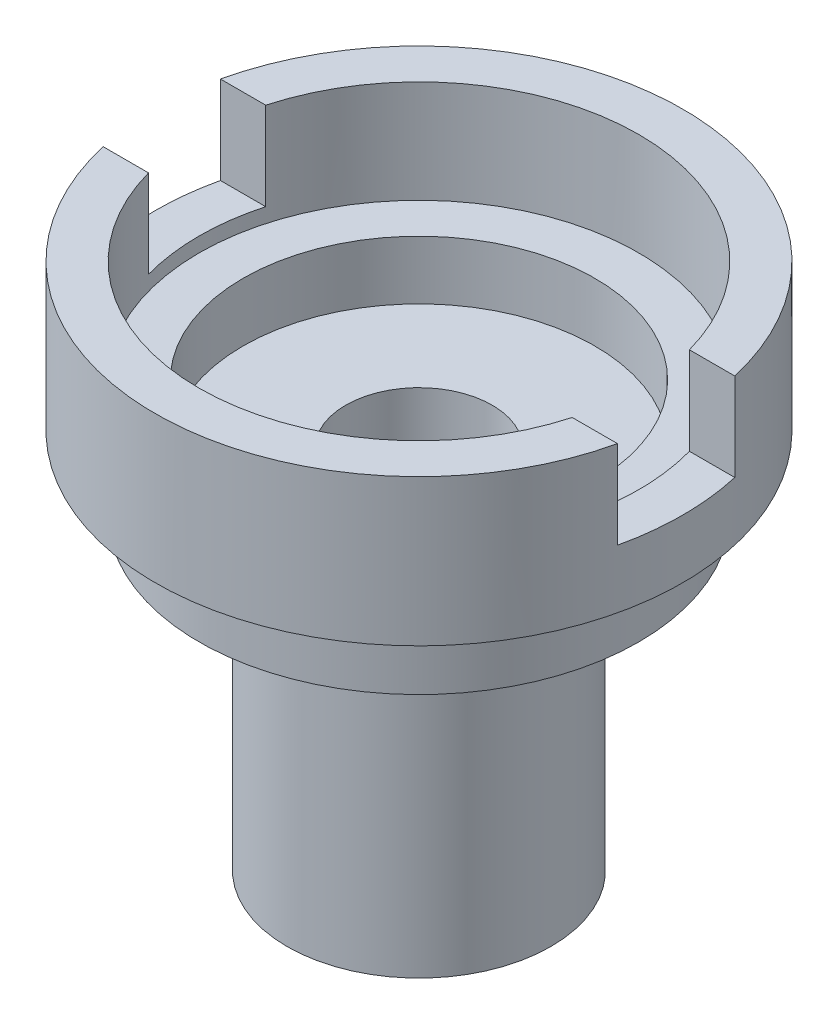
ISO-10303-21;
HEADER;
FILE_DESCRIPTION(('STEP AP214'),'2;1');
FILE_NAME('part.step','',(''),(''),'','','');
FILE_SCHEMA(('AUTOMOTIVE_DESIGN { 1 0 10303 214 1 1 1 1 }'));
ENDSEC;
DATA;
#1=APPLICATION_CONTEXT('core data for automotive mechanical design processes');
#2=APPLICATION_PROTOCOL_DEFINITION('international standard','automotive_design',2000,#1);
#3=PRODUCT_CONTEXT('',#1,'mechanical');
#4=PRODUCT('Part','Part','',(#3));
#5=PRODUCT_RELATED_PRODUCT_CATEGORY('part','',(#4));
#6=PRODUCT_DEFINITION_FORMATION('','',#4);
#7=PRODUCT_DEFINITION_CONTEXT('part definition',#1,'design');
#8=PRODUCT_DEFINITION('design','',#6,#7);
#9=PRODUCT_DEFINITION_SHAPE('','',#8);
#10=(LENGTH_UNIT() NAMED_UNIT(*) SI_UNIT(.MILLI.,.METRE.));
#11=(NAMED_UNIT(*) PLANE_ANGLE_UNIT() SI_UNIT($,.RADIAN.));
#12=(NAMED_UNIT(*) SI_UNIT($,.STERADIAN.) SOLID_ANGLE_UNIT());
#13=UNCERTAINTY_MEASURE_WITH_UNIT(LENGTH_MEASURE(1.E-05),#10,'distance_accuracy_value','');
#14=(GEOMETRIC_REPRESENTATION_CONTEXT(3) GLOBAL_UNCERTAINTY_ASSIGNED_CONTEXT((#13)) GLOBAL_UNIT_ASSIGNED_CONTEXT((#10,
#11,#12)) REPRESENTATION_CONTEXT('',''));
#15=CARTESIAN_POINT('',(0.,0.,0.));
#16=DIRECTION('',(0.,0.,1.));
#17=DIRECTION('',(1.,0.,0.));
#18=AXIS2_PLACEMENT_3D('',#15,#16,#17);
#19=CARTESIAN_POINT('',(-90.,180.,0.));
#20=DIRECTION('',(0.,1.,0.));
#21=DIRECTION('',(-1.,0.,0.));
#22=AXIS2_PLACEMENT_3D('',#19,#20,#21);
#23=PLANE('',#22);
#24=CARTESIAN_POINT('',(0.,180.,0.));
#25=DIRECTION('',(0.,1.,0.));
#26=DIRECTION('',(-1.,0.,0.));
#27=AXIS2_PLACEMENT_3D('',#24,#25,#26);
#28=CIRCLE('',#27,90.);
#29=CARTESIAN_POINT('',(87.7496438739211,180.,-20.));
#30=VERTEX_POINT('',#29);
#31=CARTESIAN_POINT('',(-87.7496438739212,180.,-20.));
#32=VERTEX_POINT('',#31);
#33=EDGE_CURVE('E136',#30,#32,#28,.T.);
#34=ORIENTED_EDGE('',*,*,#33,.T.);
#35=DIRECTION('',(1.,0.,0.));
#36=VECTOR('',#35,1.);
#37=CARTESIAN_POINT('',(-114.831719663084,180.,-20.));
#38=LINE('',#37,#36);
#39=CARTESIAN_POINT('',(-72.2841614740047,180.,-20.));
#40=VERTEX_POINT('',#39);
#41=EDGE_CURVE('E188',#32,#40,#38,.T.);
#42=ORIENTED_EDGE('',*,*,#41,.T.);
#43=CARTESIAN_POINT('',(0.,180.,0.));
#44=DIRECTION('',(0.,1.,0.));
#45=DIRECTION('',(-1.,0.,0.));
#46=AXIS2_PLACEMENT_3D('',#43,#44,#45);
#47=CIRCLE('',#46,75.);
#48=CARTESIAN_POINT('',(72.2841614740048,180.,-20.));
#49=VERTEX_POINT('',#48);
#50=EDGE_CURVE('E195',#49,#40,#47,.T.);
#51=ORIENTED_EDGE('',*,*,#50,.F.);
#52=EDGE_CURVE('E127',#49,#30,#38,.T.);
#53=ORIENTED_EDGE('',*,*,#52,.T.);
#54=EDGE_LOOP('',(#34,#42,#51,#53));
#55=FACE_BOUND('',#54,.T.);
#56=ADVANCED_FACE('F42',(#55),#23,.T.);
#57=CARTESIAN_POINT('',(0.,0.,0.));
#58=DIRECTION('',(0.,-1.,0.));
#59=DIRECTION('',(1.,0.,0.));
#60=AXIS2_PLACEMENT_3D('',#57,#58,#59);
#61=PLANE('',#60);
#62=CARTESIAN_POINT('',(0.,0.,0.));
#63=DIRECTION('',(0.,1.,0.));
#64=DIRECTION('',(-1.,0.,0.));
#65=AXIS2_PLACEMENT_3D('',#62,#63,#64);
#66=CIRCLE('',#65,25.);
#67=CARTESIAN_POINT('',(-25.,0.,0.));
#68=VERTEX_POINT('',#67);
#69=EDGE_CURVE('E194',#68,#68,#66,.T.);
#70=ORIENTED_EDGE('',*,*,#69,.T.);
#71=EDGE_LOOP('',(#70));
#72=FACE_BOUND('',#71,.T.);
#73=CARTESIAN_POINT('',(0.,0.,0.));
#74=DIRECTION('',(0.,1.,0.));
#75=DIRECTION('',(-1.,0.,0.));
#76=AXIS2_PLACEMENT_3D('',#73,#74,#75);
#77=CIRCLE('',#76,45.);
#78=CARTESIAN_POINT('',(-45.,0.,0.));
#79=VERTEX_POINT('',#78);
#80=EDGE_CURVE('E159',#79,#79,#77,.T.);
#81=ORIENTED_EDGE('',*,*,#80,.F.);
#82=EDGE_LOOP('',(#81));
#83=FACE_BOUND('',#82,.T.);
#84=ADVANCED_FACE('F44',(#72,#83),#61,.T.);
#85=CARTESIAN_POINT('',(0.,209.327847516351,0.));
#86=DIRECTION('',(0.,1.,0.));
#87=DIRECTION('',(-1.,0.,0.));
#88=AXIS2_PLACEMENT_3D('',#85,#86,#87);
#89=CYLINDRICAL_SURFACE('',#88,45.);
#90=ORIENTED_EDGE('',*,*,#80,.T.);
#91=EDGE_LOOP('',(#90));
#92=FACE_BOUND('',#91,.T.);
#93=CARTESIAN_POINT('',(0.,105.,0.));
#94=DIRECTION('',(0.,1.,0.));
#95=DIRECTION('',(-1.,0.,0.));
#96=AXIS2_PLACEMENT_3D('',#93,#94,#95);
#97=CIRCLE('',#96,45.);
#98=CARTESIAN_POINT('',(-45.,105.,0.));
#99=VERTEX_POINT('',#98);
#100=EDGE_CURVE('E155',#99,#99,#97,.T.);
#101=ORIENTED_EDGE('',*,*,#100,.F.);
#102=EDGE_LOOP('',(#101));
#103=FACE_BOUND('',#102,.T.);
#104=ADVANCED_FACE('F260',(#92,#103),#89,.T.);
#105=CARTESIAN_POINT('',(-45.,105.,0.));
#106=DIRECTION('',(0.,-1.,0.));
#107=DIRECTION('',(1.,0.,0.));
#108=AXIS2_PLACEMENT_3D('',#105,#106,#107);
#109=PLANE('',#108);
#110=ORIENTED_EDGE('',*,*,#100,.T.);
#111=EDGE_LOOP('',(#110));
#112=FACE_BOUND('',#111,.T.);
#113=CARTESIAN_POINT('',(0.,105.,0.));
#114=DIRECTION('',(0.,1.,0.));
#115=DIRECTION('',(-1.,0.,0.));
#116=AXIS2_PLACEMENT_3D('',#113,#114,#115);
#117=CIRCLE('',#116,75.);
#118=CARTESIAN_POINT('',(-75.,105.,0.));
#119=VERTEX_POINT('',#118);
#120=EDGE_CURVE('E151',#119,#119,#117,.T.);
#121=ORIENTED_EDGE('',*,*,#120,.F.);
#122=EDGE_LOOP('',(#121));
#123=FACE_BOUND('',#122,.T.);
#124=ADVANCED_FACE('F282',(#112,#123),#109,.T.);
#125=CARTESIAN_POINT('',(0.,209.327847516351,0.));
#126=DIRECTION('',(0.,1.,0.));
#127=DIRECTION('',(-1.,0.,0.));
#128=AXIS2_PLACEMENT_3D('',#125,#126,#127);
#129=CYLINDRICAL_SURFACE('',#128,75.);
#130=ORIENTED_EDGE('',*,*,#120,.T.);
#131=EDGE_LOOP('',(#130));
#132=FACE_BOUND('',#131,.T.);
#133=CARTESIAN_POINT('',(0.,130.,0.));
#134=DIRECTION('',(0.,1.,0.));
#135=DIRECTION('',(-1.,0.,0.));
#136=AXIS2_PLACEMENT_3D('',#133,#134,#135);
#137=CIRCLE('',#136,75.);
#138=CARTESIAN_POINT('',(-75.,130.,0.));
#139=VERTEX_POINT('',#138);
#140=EDGE_CURVE('E141',#139,#139,#137,.T.);
#141=ORIENTED_EDGE('',*,*,#140,.F.);
#142=EDGE_LOOP('',(#141));
#143=FACE_BOUND('',#142,.T.);
#144=ADVANCED_FACE('F276',(#132,#143),#129,.T.);
#145=CARTESIAN_POINT('',(-75.,130.,0.));
#146=DIRECTION('',(0.,-1.,0.));
#147=DIRECTION('',(1.,0.,0.));
#148=AXIS2_PLACEMENT_3D('',#145,#146,#147);
#149=PLANE('',#148);
#150=ORIENTED_EDGE('',*,*,#140,.T.);
#151=EDGE_LOOP('',(#150));
#152=FACE_BOUND('',#151,.T.);
#153=CARTESIAN_POINT('',(0.,130.,0.));
#154=DIRECTION('',(0.,1.,0.));
#155=DIRECTION('',(-1.,0.,0.));
#156=AXIS2_PLACEMENT_3D('',#153,#154,#155);
#157=CIRCLE('',#156,90.);
#158=CARTESIAN_POINT('',(-90.,130.,0.));
#159=VERTEX_POINT('',#158);
#160=EDGE_CURVE('E135',#159,#159,#157,.T.);
#161=ORIENTED_EDGE('',*,*,#160,.F.);
#162=EDGE_LOOP('',(#161));
#163=FACE_BOUND('',#162,.T.);
#164=ADVANCED_FACE('F272',(#152,#163),#149,.T.);
#165=CARTESIAN_POINT('',(0.,209.327847516351,0.));
#166=DIRECTION('',(0.,1.,0.));
#167=DIRECTION('',(-1.,0.,0.));
#168=AXIS2_PLACEMENT_3D('',#165,#166,#167);
#169=CYLINDRICAL_SURFACE('',#168,90.);
#170=DIRECTION('',(0.,1.,0.));
#171=VECTOR('',#170,1.);
#172=CARTESIAN_POINT('',(-87.7496438739212,209.327847516351,20.));
#173=LINE('',#172,#171);
#174=CARTESIAN_POINT('',(-87.7496438739212,150.,20.));
#175=VERTEX_POINT('',#174);
#176=CARTESIAN_POINT('',(-87.7496438739212,180.,20.));
#177=VERTEX_POINT('',#176);
#178=EDGE_CURVE('E106',#175,#177,#173,.T.);
#179=ORIENTED_EDGE('',*,*,#178,.F.);
#180=CARTESIAN_POINT('',(0.,150.,0.));
#181=DIRECTION('',(0.,-1.,0.));
#182=DIRECTION('',(0.,0.,-1.));
#183=AXIS2_PLACEMENT_3D('',#180,#181,#182);
#184=CIRCLE('',#183,90.);
#185=CARTESIAN_POINT('',(-87.7496438739212,150.,-20.));
#186=VERTEX_POINT('',#185);
#187=EDGE_CURVE('E222',#186,#175,#184,.F.);
#188=ORIENTED_EDGE('',*,*,#187,.F.);
#189=DIRECTION('',(0.,1.,0.));
#190=VECTOR('',#189,1.);
#191=CARTESIAN_POINT('',(-87.7496438739212,209.327847516351,-20.));
#192=LINE('',#191,#190);
#193=EDGE_CURVE('E218',#186,#32,#192,.T.);
#194=ORIENTED_EDGE('',*,*,#193,.T.);
#195=ORIENTED_EDGE('',*,*,#33,.F.);
#196=DIRECTION('',(0.,1.,0.));
#197=VECTOR('',#196,1.);
#198=CARTESIAN_POINT('',(87.7496438739212,209.327847516351,-20.));
#199=LINE('',#198,#197);
#200=CARTESIAN_POINT('',(87.7496438739212,150.,-20.));
#201=VERTEX_POINT('',#200);
#202=EDGE_CURVE('E116',#30,#201,#199,.F.);
#203=ORIENTED_EDGE('',*,*,#202,.T.);
#204=CARTESIAN_POINT('',(87.7496438739212,150.,20.));
#205=VERTEX_POINT('',#204);
#206=EDGE_CURVE('E223',#205,#201,#184,.F.);
#207=ORIENTED_EDGE('',*,*,#206,.F.);
#208=DIRECTION('',(0.,1.,0.));
#209=VECTOR('',#208,1.);
#210=CARTESIAN_POINT('',(87.7496438739212,209.327847516351,20.));
#211=LINE('',#210,#209);
#212=CARTESIAN_POINT('',(87.7496438739211,180.,20.));
#213=VERTEX_POINT('',#212);
#214=EDGE_CURVE('E115',#213,#205,#211,.F.);
#215=ORIENTED_EDGE('',*,*,#214,.F.);
#216=EDGE_CURVE('E123',#177,#213,#28,.T.);
#217=ORIENTED_EDGE('',*,*,#216,.F.);
#218=EDGE_LOOP('',(#179,#188,#194,#195,#203,#207,#215,#217));
#219=FACE_BOUND('',#218,.T.);
#220=ORIENTED_EDGE('',*,*,#160,.T.);
#221=EDGE_LOOP('',(#220));
#222=FACE_BOUND('',#221,.T.);
#223=ADVANCED_FACE('F131',(#219,#222),#169,.T.);
#224=DIRECTION('',(1.,0.,0.));
#225=VECTOR('',#224,1.);
#226=CARTESIAN_POINT('',(-114.831719663084,180.,20.));
#227=LINE('',#226,#225);
#228=CARTESIAN_POINT('',(-72.2841614740047,180.,20.));
#229=VERTEX_POINT('',#228);
#230=EDGE_CURVE('E109',#177,#229,#227,.T.);
#231=ORIENTED_EDGE('',*,*,#230,.F.);
#232=ORIENTED_EDGE('',*,*,#216,.T.);
#233=CARTESIAN_POINT('',(72.2841614740048,180.,20.));
#234=VERTEX_POINT('',#233);
#235=EDGE_CURVE('E128',#234,#213,#227,.T.);
#236=ORIENTED_EDGE('',*,*,#235,.F.);
#237=EDGE_CURVE('E125',#229,#234,#47,.T.);
#238=ORIENTED_EDGE('',*,*,#237,.F.);
#239=EDGE_LOOP('',(#231,#232,#236,#238));
#240=FACE_BOUND('',#239,.T.);
#241=ADVANCED_FACE('F121',(#240),#23,.T.);
#242=CARTESIAN_POINT('',(25.,125.,0.));
#243=DIRECTION('',(0.,1.,0.));
#244=DIRECTION('',(-1.,0.,0.));
#245=AXIS2_PLACEMENT_3D('',#242,#243,#244);
#246=PLANE('',#245);
#247=CARTESIAN_POINT('',(0.,125.,0.));
#248=DIRECTION('',(0.,1.,0.));
#249=DIRECTION('',(-1.,0.,0.));
#250=AXIS2_PLACEMENT_3D('',#247,#248,#249);
#251=CIRCLE('',#250,60.);
#252=CARTESIAN_POINT('',(-60.,125.,0.));
#253=VERTEX_POINT('',#252);
#254=EDGE_CURVE('E209',#253,#253,#251,.T.);
#255=ORIENTED_EDGE('',*,*,#254,.T.);
#256=EDGE_LOOP('',(#255));
#257=FACE_BOUND('',#256,.T.);
#258=CARTESIAN_POINT('',(0.,125.,0.));
#259=DIRECTION('',(0.,1.,0.));
#260=DIRECTION('',(-1.,0.,0.));
#261=AXIS2_PLACEMENT_3D('',#258,#259,#260);
#262=CIRCLE('',#261,25.);
#263=CARTESIAN_POINT('',(-25.,125.,0.));
#264=VERTEX_POINT('',#263);
#265=EDGE_CURVE('E144',#264,#264,#262,.T.);
#266=ORIENTED_EDGE('',*,*,#265,.F.);
#267=EDGE_LOOP('',(#266));
#268=FACE_BOUND('',#267,.T.);
#269=ADVANCED_FACE('F265',(#257,#268),#246,.T.);
#270=CARTESIAN_POINT('',(0.,180.,0.));
#271=DIRECTION('',(0.,1.,0.));
#272=DIRECTION('',(-1.,0.,0.));
#273=AXIS2_PLACEMENT_3D('',#270,#271,#272);
#274=CYLINDRICAL_SURFACE('',#273,25.);
#275=ORIENTED_EDGE('',*,*,#265,.T.);
#276=EDGE_LOOP('',(#275));
#277=FACE_BOUND('',#276,.T.);
#278=ORIENTED_EDGE('',*,*,#69,.F.);
#279=EDGE_LOOP('',(#278));
#280=FACE_BOUND('',#279,.T.);
#281=ADVANCED_FACE('F270',(#277,#280),#274,.F.);
#282=CARTESIAN_POINT('',(0.,180.,0.));
#283=DIRECTION('',(0.,1.,0.));
#284=DIRECTION('',(-1.,0.,0.));
#285=AXIS2_PLACEMENT_3D('',#282,#283,#284);
#286=CYLINDRICAL_SURFACE('',#285,75.);
#287=DIRECTION('',(0.,1.,0.));
#288=VECTOR('',#287,1.);
#289=CARTESIAN_POINT('',(72.2841614740048,180.,20.));
#290=LINE('',#289,#288);
#291=CARTESIAN_POINT('',(72.2841614740048,150.,20.));
#292=VERTEX_POINT('',#291);
#293=EDGE_CURVE('E11',#292,#234,#290,.T.);
#294=ORIENTED_EDGE('',*,*,#293,.F.);
#295=CARTESIAN_POINT('',(0.,150.,0.));
#296=DIRECTION('',(0.,-1.,0.));
#297=DIRECTION('',(0.,0.,-1.));
#298=AXIS2_PLACEMENT_3D('',#295,#296,#297);
#299=CIRCLE('',#298,75.);
#300=CARTESIAN_POINT('',(72.2841614740048,150.,-20.));
#301=VERTEX_POINT('',#300);
#302=EDGE_CURVE('E167',#301,#292,#299,.T.);
#303=ORIENTED_EDGE('',*,*,#302,.F.);
#304=DIRECTION('',(0.,1.,0.));
#305=VECTOR('',#304,1.);
#306=CARTESIAN_POINT('',(72.2841614740048,180.,-20.));
#307=LINE('',#306,#305);
#308=EDGE_CURVE('E51',#301,#49,#307,.T.);
#309=ORIENTED_EDGE('',*,*,#308,.T.);
#310=ORIENTED_EDGE('',*,*,#50,.T.);
#311=DIRECTION('',(0.,1.,0.));
#312=VECTOR('',#311,1.);
#313=CARTESIAN_POINT('',(-72.2841614740048,180.,-20.));
#314=LINE('',#313,#312);
#315=CARTESIAN_POINT('',(-72.2841614740047,150.,-20.));
#316=VERTEX_POINT('',#315);
#317=EDGE_CURVE('E166',#40,#316,#314,.F.);
#318=ORIENTED_EDGE('',*,*,#317,.T.);
#319=CARTESIAN_POINT('',(-72.2841614740047,150.,20.));
#320=VERTEX_POINT('',#319);
#321=EDGE_CURVE('E163',#320,#316,#299,.T.);
#322=ORIENTED_EDGE('',*,*,#321,.F.);
#323=DIRECTION('',(0.,1.,0.));
#324=VECTOR('',#323,1.);
#325=CARTESIAN_POINT('',(-72.2841614740047,180.,20.));
#326=LINE('',#325,#324);
#327=EDGE_CURVE('E171',#229,#320,#326,.F.);
#328=ORIENTED_EDGE('',*,*,#327,.F.);
#329=ORIENTED_EDGE('',*,*,#237,.T.);
#330=EDGE_LOOP('',(#294,#303,#309,#310,#318,#322,#328,#329));
#331=FACE_BOUND('',#330,.T.);
#332=CARTESIAN_POINT('',(0.,145.,0.));
#333=DIRECTION('',(0.,1.,0.));
#334=DIRECTION('',(-1.,0.,0.));
#335=AXIS2_PLACEMENT_3D('',#332,#333,#334);
#336=CIRCLE('',#335,75.);
#337=CARTESIAN_POINT('',(-75.,145.,0.));
#338=VERTEX_POINT('',#337);
#339=EDGE_CURVE('E200',#338,#338,#336,.T.);
#340=ORIENTED_EDGE('',*,*,#339,.F.);
#341=EDGE_LOOP('',(#340));
#342=FACE_BOUND('',#341,.T.);
#343=ADVANCED_FACE('F190',(#331,#342),#286,.F.);
#344=CARTESIAN_POINT('',(60.,145.,0.));
#345=DIRECTION('',(0.,1.,0.));
#346=DIRECTION('',(-1.,0.,0.));
#347=AXIS2_PLACEMENT_3D('',#344,#345,#346);
#348=PLANE('',#347);
#349=ORIENTED_EDGE('',*,*,#339,.T.);
#350=EDGE_LOOP('',(#349));
#351=FACE_BOUND('',#350,.T.);
#352=CARTESIAN_POINT('',(0.,145.,0.));
#353=DIRECTION('',(0.,1.,0.));
#354=DIRECTION('',(-1.,0.,0.));
#355=AXIS2_PLACEMENT_3D('',#352,#353,#354);
#356=CIRCLE('',#355,60.);
#357=CARTESIAN_POINT('',(-60.,145.,0.));
#358=VERTEX_POINT('',#357);
#359=EDGE_CURVE('E205',#358,#358,#356,.T.);
#360=ORIENTED_EDGE('',*,*,#359,.F.);
#361=EDGE_LOOP('',(#360));
#362=FACE_BOUND('',#361,.T.);
#363=ADVANCED_FACE('F346',(#351,#362),#348,.T.);
#364=CARTESIAN_POINT('',(0.,180.,0.));
#365=DIRECTION('',(0.,1.,0.));
#366=DIRECTION('',(-1.,0.,0.));
#367=AXIS2_PLACEMENT_3D('',#364,#365,#366);
#368=CYLINDRICAL_SURFACE('',#367,60.);
#369=ORIENTED_EDGE('',*,*,#359,.T.);
#370=EDGE_LOOP('',(#369));
#371=FACE_BOUND('',#370,.T.);
#372=ORIENTED_EDGE('',*,*,#254,.F.);
#373=EDGE_LOOP('',(#372));
#374=FACE_BOUND('',#373,.T.);
#375=ADVANCED_FACE('F351',(#371,#374),#368,.F.);
#376=CARTESIAN_POINT('',(0.,150.,0.));
#377=DIRECTION('',(0.,-1.,0.));
#378=DIRECTION('',(0.,0.,-1.));
#379=AXIS2_PLACEMENT_3D('',#376,#377,#378);
#380=PLANE('',#379);
#381=ORIENTED_EDGE('',*,*,#187,.T.);
#382=DIRECTION('',(1.,0.,0.));
#383=VECTOR('',#382,1.);
#384=CARTESIAN_POINT('',(-114.831719663084,150.,20.));
#385=LINE('',#384,#383);
#386=EDGE_CURVE('E66',#175,#320,#385,.T.);
#387=ORIENTED_EDGE('',*,*,#386,.T.);
#388=ORIENTED_EDGE('',*,*,#321,.T.);
#389=DIRECTION('',(1.,0.,0.));
#390=VECTOR('',#389,1.);
#391=CARTESIAN_POINT('',(-114.831719663084,150.,-20.));
#392=LINE('',#391,#390);
#393=EDGE_CURVE('E226',#186,#316,#392,.T.);
#394=ORIENTED_EDGE('',*,*,#393,.F.);
#395=EDGE_LOOP('',(#381,#387,#388,#394));
#396=FACE_BOUND('',#395,.T.);
#397=ADVANCED_FACE('F243',(#396),#380,.F.);
#398=CARTESIAN_POINT('',(-114.831719663084,150.,-20.));
#399=DIRECTION('',(0.,0.,1.));
#400=DIRECTION('',(1.,0.,0.));
#401=AXIS2_PLACEMENT_3D('',#398,#399,#400);
#402=PLANE('',#401);
#403=ORIENTED_EDGE('',*,*,#393,.T.);
#404=ORIENTED_EDGE('',*,*,#317,.F.);
#405=ORIENTED_EDGE('',*,*,#41,.F.);
#406=ORIENTED_EDGE('',*,*,#193,.F.);
#407=EDGE_LOOP('',(#403,#404,#405,#406));
#408=FACE_BOUND('',#407,.T.);
#409=ADVANCED_FACE('F241',(#408),#402,.T.);
#410=CARTESIAN_POINT('',(-114.831719663084,150.,20.));
#411=DIRECTION('',(0.,0.,1.));
#412=DIRECTION('',(1.,0.,0.));
#413=AXIS2_PLACEMENT_3D('',#410,#411,#412);
#414=PLANE('',#413);
#415=ORIENTED_EDGE('',*,*,#178,.T.);
#416=ORIENTED_EDGE('',*,*,#230,.T.);
#417=ORIENTED_EDGE('',*,*,#327,.T.);
#418=ORIENTED_EDGE('',*,*,#386,.F.);
#419=EDGE_LOOP('',(#415,#416,#417,#418));
#420=FACE_BOUND('',#419,.T.);
#421=ADVANCED_FACE('F108',(#420),#414,.F.);
#422=ORIENTED_EDGE('',*,*,#214,.T.);
#423=EDGE_CURVE('E183',#292,#205,#385,.T.);
#424=ORIENTED_EDGE('',*,*,#423,.F.);
#425=ORIENTED_EDGE('',*,*,#293,.T.);
#426=ORIENTED_EDGE('',*,*,#235,.T.);
#427=EDGE_LOOP('',(#422,#424,#425,#426));
#428=FACE_BOUND('',#427,.T.);
#429=ADVANCED_FACE('F186',(#428),#414,.F.);
#430=ORIENTED_EDGE('',*,*,#52,.F.);
#431=ORIENTED_EDGE('',*,*,#308,.F.);
#432=EDGE_CURVE('E58',#301,#201,#392,.T.);
#433=ORIENTED_EDGE('',*,*,#432,.T.);
#434=ORIENTED_EDGE('',*,*,#202,.F.);
#435=EDGE_LOOP('',(#430,#431,#433,#434));
#436=FACE_BOUND('',#435,.T.);
#437=ADVANCED_FACE('F245',(#436),#402,.T.);
#438=ORIENTED_EDGE('',*,*,#206,.T.);
#439=ORIENTED_EDGE('',*,*,#432,.F.);
#440=ORIENTED_EDGE('',*,*,#302,.T.);
#441=ORIENTED_EDGE('',*,*,#423,.T.);
#442=EDGE_LOOP('',(#438,#439,#440,#441));
#443=FACE_BOUND('',#442,.T.);
#444=ADVANCED_FACE('F182',(#443),#380,.F.);
#445=CLOSED_SHELL('',(#56,#84,#104,#124,#144,#164,#223,#241,#269,#281,#343,#363,#375,#397,#409,
#421,#429,#437,#444));
#446=MANIFOLD_SOLID_BREP('B2',#445);
#447=ADVANCED_BREP_SHAPE_REPRESENTATION('',(#18,#446),#14);
#448=SHAPE_DEFINITION_REPRESENTATION(#9,#447);
ENDSEC;
END-ISO-10303-21;
